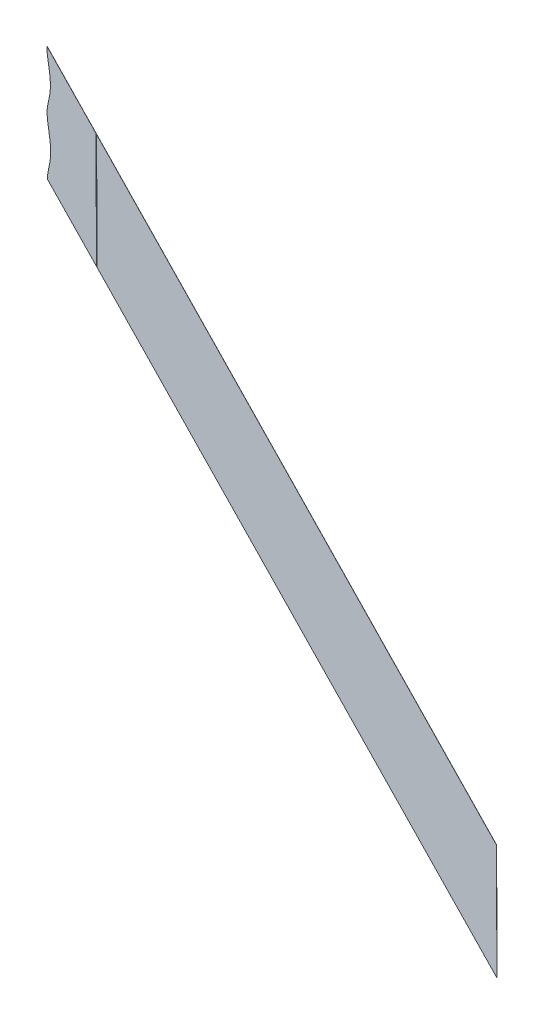
ISO-10303-21;
HEADER;
FILE_DESCRIPTION(('STEP AP214'),'2;1');
FILE_NAME('part.step','',(''),(''),'','','');
FILE_SCHEMA(('AUTOMOTIVE_DESIGN { 1 0 10303 214 1 1 1 1 }'));
ENDSEC;
DATA;
#1=APPLICATION_CONTEXT('core data for automotive mechanical design processes');
#2=APPLICATION_PROTOCOL_DEFINITION('international standard','automotive_design',2000,#1);
#3=PRODUCT_CONTEXT('',#1,'mechanical');
#4=PRODUCT('Part','Part','',(#3));
#5=PRODUCT_RELATED_PRODUCT_CATEGORY('part','',(#4));
#6=PRODUCT_DEFINITION_FORMATION('','',#4);
#7=PRODUCT_DEFINITION_CONTEXT('part definition',#1,'design');
#8=PRODUCT_DEFINITION('design','',#6,#7);
#9=PRODUCT_DEFINITION_SHAPE('','',#8);
#10=(LENGTH_UNIT() NAMED_UNIT(*) SI_UNIT(.MILLI.,.METRE.));
#11=(NAMED_UNIT(*) PLANE_ANGLE_UNIT() SI_UNIT($,.RADIAN.));
#12=(NAMED_UNIT(*) SI_UNIT($,.STERADIAN.) SOLID_ANGLE_UNIT());
#13=UNCERTAINTY_MEASURE_WITH_UNIT(LENGTH_MEASURE(1.E-05),#10,'distance_accuracy_value','');
#14=(GEOMETRIC_REPRESENTATION_CONTEXT(3) GLOBAL_UNCERTAINTY_ASSIGNED_CONTEXT((#13)) GLOBAL_UNIT_ASSIGNED_CONTEXT((#10,
#11,#12)) REPRESENTATION_CONTEXT('',''));
#15=CARTESIAN_POINT('',(0.,0.,0.));
#16=DIRECTION('',(0.,0.,1.));
#17=DIRECTION('',(1.,0.,0.));
#18=AXIS2_PLACEMENT_3D('',#15,#16,#17);
#19=CARTESIAN_POINT('',(635.389467683659,-79.4316688549312,337.647050536745));
#20=DIRECTION('',(0.00180154985013906,-0.999992126449228,-0.00353574004899396));
#21=DIRECTION('',(0.,0.00353574578677481,-0.99999374923133));
#22=AXIS2_PLACEMENT_3D('',#19,#20,#21);
#23=PLANE('',#22);
#24=DIRECTION('',(-0.891006492345561,0.,-0.453990562234571));
#25=VECTOR('',#24,1.);
#26=CARTESIAN_POINT('',(635.389467683659,-79.4316688549312,337.647050536745));
#27=LINE('',#26,#25);
#28=CARTESIAN_POINT('',(635.389467683659,-79.4316688549312,337.647050536745));
#29=VERTEX_POINT('',#28);
#30=CARTESIAN_POINT('',(74.9463839983014,-79.4316688549299,52.0869868911996));
#31=VERTEX_POINT('',#30);
#32=EDGE_CURVE('E111',#29,#31,#27,.T.);
#33=ORIENTED_EDGE('',*,*,#32,.T.);
#34=DIRECTION('',(-0.453986987716828,-0.00396825396825804,0.890999476960701));
#35=VECTOR('',#34,1.);
#36=CARTESIAN_POINT('',(79.4862538754697,-79.3919863152472,43.1769921215926));
#37=LINE('',#36,#35);
#38=CARTESIAN_POINT('',(74.9917826970728,-79.4312720295334,51.9978869435038));
#39=VERTEX_POINT('',#38);
#40=EDGE_CURVE('E60',#39,#31,#37,.T.);
#41=ORIENTED_EDGE('',*,*,#40,.F.);
#42=DIRECTION('',(-0.891006492345561,0.,-0.453990562234571));
#43=VECTOR('',#42,1.);
#44=CARTESIAN_POINT('',(635.434866382431,-79.4312720295343,337.557950589049));
#45=LINE('',#44,#43);
#46=CARTESIAN_POINT('',(635.434866382431,-79.4312720295343,337.557950589049));
#47=VERTEX_POINT('',#46);
#48=EDGE_CURVE('E54',#47,#39,#45,.T.);
#49=ORIENTED_EDGE('',*,*,#48,.F.);
#50=DIRECTION('',(0.453986987716831,0.00396825396825805,-0.890999476960699));
#51=VECTOR('',#50,1.);
#52=CARTESIAN_POINT('',(635.389467683659,-79.4316688549312,337.647050536745));
#53=LINE('',#52,#51);
#54=EDGE_CURVE('E112',#29,#47,#53,.T.);
#55=ORIENTED_EDGE('',*,*,#54,.F.);
#56=EDGE_LOOP('',(#33,#41,#49,#55));
#57=FACE_BOUND('',#56,.T.);
#58=ADVANCED_FACE('F51',(#57),#23,.T.);
#59=CARTESIAN_POINT('',(635.389467683659,-79.4316688549312,337.647050536745));
#60=DIRECTION('',(-0.891006492345559,0.,-0.453990562234575));
#61=DIRECTION('',(-0.453990562234575,0.,0.891006492345558));
#62=AXIS2_PLACEMENT_3D('',#59,#60,#61);
#63=PLANE('',#62);
#64=DIRECTION('',(-0.00180154985013892,0.999992126449228,0.00353574004899426));
#65=VECTOR('',#64,1.);
#66=CARTESIAN_POINT('',(635.434866382431,-79.4312720295343,337.557950589049));
#67=LINE('',#66,#65);
#68=CARTESIAN_POINT('',(635.291855937702,-0.0500000000001055,337.838624341603));
#69=VERTEX_POINT('',#68);
#70=EDGE_CURVE('E113',#47,#69,#67,.T.);
#71=ORIENTED_EDGE('',*,*,#70,.T.);
#72=DIRECTION('',(0.453986987716831,0.00396825396825805,-0.890999476960699));
#73=VECTOR('',#72,1.);
#74=CARTESIAN_POINT('',(635.24645723893,-0.0503968253969048,337.927724289299));
#75=LINE('',#74,#73);
#76=CARTESIAN_POINT('',(635.24645723893,-0.0503968253969048,337.927724289299));
#77=VERTEX_POINT('',#76);
#78=EDGE_CURVE('E129',#77,#69,#75,.T.);
#79=ORIENTED_EDGE('',*,*,#78,.F.);
#80=DIRECTION('',(-0.00180154985013892,0.999992126449228,0.00353574004899426));
#81=VECTOR('',#80,1.);
#82=CARTESIAN_POINT('',(635.389467683659,-79.4316688549312,337.647050536745));
#83=LINE('',#82,#81);
#84=EDGE_CURVE('E95',#29,#77,#83,.T.);
#85=ORIENTED_EDGE('',*,*,#84,.F.);
#86=ORIENTED_EDGE('',*,*,#54,.T.);
#87=EDGE_LOOP('',(#71,#79,#85,#86));
#88=FACE_BOUND('',#87,.T.);
#89=ADVANCED_FACE('F153',(#88),#63,.F.);
#90=CARTESIAN_POINT('',(635.24645723893,-0.0503968253969048,337.927724289299));
#91=DIRECTION('',(0.00180154985013904,-0.999992126449228,-0.00353574004899397));
#92=DIRECTION('',(0.,0.00353574578677482,-0.99999374923133));
#93=AXIS2_PLACEMENT_3D('',#90,#91,#92);
#94=PLANE('',#93);
#95=DIRECTION('',(-0.891006492345561,0.,-0.453990562234571));
#96=VECTOR('',#95,1.);
#97=CARTESIAN_POINT('',(635.291855937702,-0.0500000000001055,337.838624341603));
#98=LINE('',#97,#96);
#99=CARTESIAN_POINT('',(73.957765759998,-0.0500000000000084,51.8245701338222));
#100=VERTEX_POINT('',#99);
#101=EDGE_CURVE('E123',#69,#100,#98,.T.);
#102=ORIENTED_EDGE('',*,*,#101,.T.);
#103=DIRECTION('',(-0.453986987716828,-0.00396825396825804,0.890999476960701));
#104=VECTOR('',#103,1.);
#105=CARTESIAN_POINT('',(78.4522369383956,-0.0107142857142806,43.003675311912));
#106=LINE('',#105,#104);
#107=CARTESIAN_POINT('',(73.9123670612273,-0.0503968253968631,51.9136700815191));
#108=VERTEX_POINT('',#107);
#109=EDGE_CURVE('E121',#100,#108,#106,.T.);
#110=ORIENTED_EDGE('',*,*,#109,.T.);
#111=DIRECTION('',(-0.891006492345561,0.,-0.453990562234571));
#112=VECTOR('',#111,1.);
#113=CARTESIAN_POINT('',(635.24645723893,-0.0503968253969048,337.927724289299));
#114=LINE('',#113,#112);
#115=EDGE_CURVE('E117',#77,#108,#114,.T.);
#116=ORIENTED_EDGE('',*,*,#115,.F.);
#117=ORIENTED_EDGE('',*,*,#78,.T.);
#118=EDGE_LOOP('',(#102,#110,#116,#117));
#119=FACE_BOUND('',#118,.T.);
#120=ADVANCED_FACE('F138',(#119),#94,.F.);
#121=CARTESIAN_POINT('',(6923.77608602789,7071.97520177728,3573.59092223117));
#122=DIRECTION('',(-0.453986987716828,-0.00396825396825805,0.890999476960702));
#123=DIRECTION('',(0.891006492345561,0.,0.453990562234571));
#124=AXIS2_PLACEMENT_3D('',#121,#122,#123);
#125=PLANE('',#124);
#126=DIRECTION('',(-0.891008313644605,0.00202190668477135,-0.453982485245365));
#127=VECTOR('',#126,1.);
#128=CARTESIAN_POINT('',(73.9123670612273,-0.0503968253968631,51.9136700815191));
#129=LINE('',#128,#127);
#130=CARTESIAN_POINT('',(74.8033771961746,-0.0524187362146294,52.3676534947462));
#131=VERTEX_POINT('',#130);
#132=EDGE_CURVE('E83',#131,#108,#129,.T.);
#133=ORIENTED_EDGE('',*,*,#132,.F.);
#134=DIRECTION('',(-0.00180154985013957,0.999992126449228,0.00353574004899367));
#135=VECTOR('',#134,1.);
#136=CARTESIAN_POINT('',(74.8033771961746,-0.0524187362146294,52.3676534947462));
#137=LINE('',#136,#135);
#138=EDGE_CURVE('E14',#31,#131,#137,.T.);
#139=ORIENTED_EDGE('',*,*,#138,.F.);
#140=ORIENTED_EDGE('',*,*,#32,.F.);
#141=ORIENTED_EDGE('',*,*,#84,.T.);
#142=ORIENTED_EDGE('',*,*,#115,.T.);
#143=EDGE_LOOP('',(#133,#139,#140,#141,#142));
#144=FACE_BOUND('',#143,.T.);
#145=ADVANCED_FACE('F115',(#144),#125,.T.);
#146=CARTESIAN_POINT('',(6923.82148472666,7071.97559860267,3573.50182228347));
#147=DIRECTION('',(-0.453986987716828,-0.00396825396825805,0.890999476960702));
#148=DIRECTION('',(0.891006492345561,0.,0.453990562234571));
#149=AXIS2_PLACEMENT_3D('',#146,#147,#148);
#150=PLANE('',#149);
#151=DIRECTION('',(-0.00180154985013958,0.999992126449228,0.00353574004899369));
#152=VECTOR('',#151,1.);
#153=CARTESIAN_POINT('',(62.1080652803956,7071.97559860267,77.2836017110054));
#154=LINE('',#153,#152);
#155=CARTESIAN_POINT('',(74.8487758949465,-0.0520219108180245,52.27855354705));
#156=VERTEX_POINT('',#155);
#157=EDGE_CURVE('E69',#39,#156,#154,.T.);
#158=ORIENTED_EDGE('',*,*,#157,.T.);
#159=DIRECTION('',(-0.891008313644605,0.00202190668477135,-0.453982485245365));
#160=VECTOR('',#159,1.);
#161=CARTESIAN_POINT('',(6923.82148472666,-15.5939461462485,3541.93583745574));
#162=LINE('',#161,#160);
#163=EDGE_CURVE('E141',#156,#100,#162,.T.);
#164=ORIENTED_EDGE('',*,*,#163,.T.);
#165=ORIENTED_EDGE('',*,*,#101,.F.);
#166=ORIENTED_EDGE('',*,*,#70,.F.);
#167=ORIENTED_EDGE('',*,*,#48,.T.);
#168=EDGE_LOOP('',(#158,#164,#165,#166,#167));
#169=FACE_BOUND('',#168,.T.);
#170=ADVANCED_FACE('F140',(#169),#150,.F.);
#171=CARTESIAN_POINT('',(78.4522369383956,-0.0107142857142806,43.003675311912));
#172=DIRECTION('',(0.,0.999990082377723,0.00445366660163498));
#173=DIRECTION('',(0.,-0.00445366660163497,0.999990082377721));
#174=AXIS2_PLACEMENT_3D('',#171,#172,#173);
#175=PLANE('',#174);
#176=DIRECTION('',(-0.453986987716828,-0.00396825396825804,0.890999476960701));
#177=VECTOR('',#176,1.);
#178=CARTESIAN_POINT('',(79.3432470733429,-0.0127361965320469,43.4576587251391));
#179=LINE('',#178,#177);
#180=EDGE_CURVE('E88',#156,#131,#179,.T.);
#181=ORIENTED_EDGE('',*,*,#180,.T.);
#182=ORIENTED_EDGE('',*,*,#132,.T.);
#183=ORIENTED_EDGE('',*,*,#109,.F.);
#184=ORIENTED_EDGE('',*,*,#163,.F.);
#185=EDGE_LOOP('',(#181,#182,#183,#184));
#186=FACE_BOUND('',#185,.T.);
#187=ADVANCED_FACE('F142',(#186),#175,.F.);
#188=CARTESIAN_POINT('',(79.3432470733429,-0.0127361965320469,43.4576587251391));
#189=DIRECTION('',(0.891006492345561,0.,0.453990562234571));
#190=DIRECTION('',(0.453990562234571,0.,-0.89100649234556));
#191=AXIS2_PLACEMENT_3D('',#188,#189,#190);
#192=PLANE('',#191);
#193=ORIENTED_EDGE('',*,*,#40,.T.);
#194=ORIENTED_EDGE('',*,*,#138,.T.);
#195=ORIENTED_EDGE('',*,*,#180,.F.);
#196=ORIENTED_EDGE('',*,*,#157,.F.);
#197=EDGE_LOOP('',(#193,#194,#195,#196));
#198=FACE_BOUND('',#197,.T.);
#199=ADVANCED_FACE('F104',(#198),#192,.F.);
#200=CLOSED_SHELL('',(#58,#89,#120,#145,#170,#187,#199));
#201=MANIFOLD_SOLID_BREP('B2',#200);
#202=CARTESIAN_POINT('',(5.26243410756988,-79.4316688549297,16.5812348440539));
#203=CARTESIAN_POINT('',(5.26360820461807,-78.7903415981819,16.5846893625954));
#204=CARTESIAN_POINT('',(5.38315197875217,-77.5183010933937,16.651265268905));
#205=CARTESIAN_POINT('',(5.60633965182744,-76.2627654905805,16.7705768805077));
#206=CARTESIAN_POINT('',(5.91481252200815,-75.0248945888949,16.9332648045656));
#207=CARTESIAN_POINT('',(6.283497687402,-73.8142124820426,17.1265113396988));
#208=CARTESIAN_POINT('',(6.50569227325659,-73.1667405947846,17.2426088080811));
#209=CARTESIAN_POINT('',(6.6891327830747,-72.6321975381458,17.3384571326777));
#210=CARTESIAN_POINT('',(6.93427442001482,-71.9623313779317,17.4663464472209));
#211=CARTESIAN_POINT('',(7.08742969014103,-71.5438242079673,17.5462468784966));
#212=CARTESIAN_POINT('',(7.68360811486507,-69.9490598814942,17.857117630064));
#213=CARTESIAN_POINT('',(7.81838363590942,-69.58316509782,17.9274187894516));
#214=CARTESIAN_POINT('',(8.06329199287503,-68.9182766255114,18.0551670727082));
#215=CARTESIAN_POINT('',(8.2511952720859,-68.3824910726237,18.1532948259991));
#216=CARTESIAN_POINT('',(8.47487728190888,-67.7446864009421,18.2701071198972));
#217=CARTESIAN_POINT('',(8.86026724835332,-66.5491076386062,18.4717979118415));
#218=CARTESIAN_POINT('',(9.20571426589994,-65.3359620430262,18.6532149888603));
#219=CARTESIAN_POINT('',(9.66031458923566,-63.4327716841247,18.8933217225139));
#220=CARTESIAN_POINT('',(9.98064818673566,-60.8993366893968,19.0678230577956));
#221=CARTESIAN_POINT('',(9.97704735823107,-58.3434287451987,19.0773716184581));
#222=CARTESIAN_POINT('',(9.65102042077526,-55.8134844401254,18.9225202080032));
#223=CARTESIAN_POINT('',(9.18940384415612,-53.9025220958486,18.695825647101));
#224=CARTESIAN_POINT('',(8.83555751423237,-52.6742248665406,18.5210023861336));
#225=CARTESIAN_POINT('',(8.44258217525118,-51.4694471261906,18.3261371467796));
#226=CARTESIAN_POINT('',(8.21622924595738,-50.8309199627601,18.2136483640446));
#227=CARTESIAN_POINT('',(8.0263866596153,-50.2953861460189,18.1193038308613));
#228=CARTESIAN_POINT('',(7.77877296139545,-49.629838670572,17.9961024840592));
#229=CARTESIAN_POINT('',(7.64475732479142,-49.2696252847504,17.929422380976));
#230=CARTESIAN_POINT('',(7.04030688288171,-47.6681057861711,17.6285721491038));
#231=CARTESIAN_POINT('',(6.88450293252568,-47.2463056234553,17.551064633429));
#232=CARTESIAN_POINT('',(6.63885014534227,-46.5812622444663,17.4288601757772));
#233=CARTESIAN_POINT('',(6.45443071749824,-46.04917858313,17.3372635143505));
#234=CARTESIAN_POINT('',(6.22842480620445,-45.3971103375434,17.2250118542116));
#235=CARTESIAN_POINT('',(5.85508208779212,-44.1831419232214,17.0401908690163));
#236=CARTESIAN_POINT('',(5.54349746587451,-42.9469293208017,16.8869362803336));
#237=CARTESIAN_POINT('',(5.31536778495478,-41.6838793347448,16.7763236412931));
#238=CARTESIAN_POINT('',(5.19344206561179,-40.4080347140491,16.7198816164984));
#239=CARTESIAN_POINT('',(5.18838925509585,-39.1296473607725,16.7230006480283));
#240=CARTESIAN_POINT('',(5.30143777696679,-37.849506187753,16.7863031354689));
#241=CARTESIAN_POINT('',(5.52139704889354,-36.5842778222442,16.904012963001));
#242=CARTESIAN_POINT('',(5.82690474706943,-35.3422762899024,17.0652084528331));
#243=CARTESIAN_POINT('',(6.19461349446027,-34.1264519634747,17.2579803800169));
#244=CARTESIAN_POINT('',(6.41574784360521,-33.4794812591749,17.3735353985948));
#245=CARTESIAN_POINT('',(6.59803197951531,-32.9461742616463,17.4687890161045));
#246=CARTESIAN_POINT('',(6.84009593349094,-32.2832731018389,17.5950791524827));
#247=CARTESIAN_POINT('',(6.99837954184968,-31.8498075410417,17.6776592234008));
#248=CARTESIAN_POINT('',(7.28353705906987,-31.0868944241983,17.8263520550992));
#249=CARTESIAN_POINT('',(7.60346865574918,-30.2309464064917,17.993177518877));
#250=CARTESIAN_POINT('',(7.72840866401131,-29.8921951973309,18.0583463436948));
#251=CARTESIAN_POINT('',(7.97273423146111,-29.2297526174673,18.1857867875117));
#252=CARTESIAN_POINT('',(8.15933409306052,-28.6993508066504,18.2832264386132));
#253=CARTESIAN_POINT('',(8.38399909546711,-28.0607505253835,18.4005431357501));
#254=CARTESIAN_POINT('',(8.77436500955092,-26.8556419217662,18.6048117432491));
#255=CARTESIAN_POINT('',(9.12516484477754,-25.6294670906531,18.7890142460217));
#256=CARTESIAN_POINT('',(9.58322616728002,-23.7214957593647,19.0309057402054));
#257=CARTESIAN_POINT('',(9.90621019242899,-21.1952564870325,19.2067254883942));
#258=CARTESIAN_POINT('',(9.90832242137635,-18.639971985395,19.2191822210949));
#259=CARTESIAN_POINT('',(9.58489079000935,-16.1011199187427,19.0656928579645));
#260=CARTESIAN_POINT('',(9.12514805390413,-14.1894551684197,18.8399561949716));
#261=CARTESIAN_POINT('',(8.77291110328271,-12.9624297045966,18.6659472897829));
#262=CARTESIAN_POINT('',(8.37963591533458,-11.7537572562719,18.4709466156263));
#263=CARTESIAN_POINT('',(8.15204437545808,-11.1110030669795,18.3578455551181));
#264=CARTESIAN_POINT('',(7.96261738267007,-10.5760315419164,18.2637102731795));
#265=CARTESIAN_POINT('',(7.71639970101073,-9.91380101090864,18.1412054597547));
#266=CARTESIAN_POINT('',(7.57807555584367,-9.5417624493924,18.0723827274408));
#267=CARTESIAN_POINT('',(6.97331305202187,-7.93950863707089,17.7713767624766));
#268=CARTESIAN_POINT('',(6.81849893632075,-7.52060554756305,17.6943606901104));
#269=CARTESIAN_POINT('',(6.57279918590459,-6.85577996577123,17.5721313334865));
#270=CARTESIAN_POINT('',(6.38851747002717,-6.32472938864776,17.4806002387654));
#271=CARTESIAN_POINT('',(6.16480874240433,-5.68006071739308,17.3694860968081));
#272=CARTESIAN_POINT('',(5.79156333118458,-4.47093824148346,17.1846931097042));
#273=CARTESIAN_POINT('',(5.47711780115756,-3.23040520617141,17.0300000572367));
#274=CARTESIAN_POINT('',(5.24795425424562,-1.97088459782999,16.9188449182429));
#275=CARTESIAN_POINT('',(5.1229222384655,-0.69424426861648,16.8608236999407));
#276=CARTESIAN_POINT('',(5.11942366284029,-0.0503968253958223,16.8619085966075));
#277=B_SPLINE_CURVE_WITH_KNOTS('',2,(#202,#203,#204,#205,#206,#207,#208,#209,#210,#211,#212,
#213,#214,#215,#216,#217,#218,#219,#220,#221,#222,#223,#224,#225,#226,#227,#228,#229,#230,#231,
#232,#233,#234,#235,#236,#237,#238,#239,#240,#241,#242,#243,#244,#245,#246,#247,#248,#249,#250,
#251,#252,#253,#254,#255,#256,#257,#258,#259,#260,#261,#262,#263,#264,#265,#266,#267,#268,#269,
#270,#271,#272,#273,#274,#275,#276),.UNSPECIFIED.,.F.,.F.,(3,1,1,1,1,2,2,1,2,2,1,1,1,1,1,1,1,1,
1,2,2,1,2,2,1,1,1,1,1,1,1,1,1,2,2,2,2,2,1,1,1,1,1,1,1,1,1,2,2,1,2,2,1,1,1,1,3),(0.,0.015625,
0.03125,0.046875,0.0625,0.078125,0.09375,0.109375,0.125,0.140625,0.15625,0.171875,0.1875,
0.21875,0.25,0.28125,0.3125,0.328125,0.34375,0.359375,0.375,0.390625,0.40625,0.421875,0.4375,
0.453125,0.46875,0.484375,0.5,0.515625,0.53125,0.546875,0.5625,0.578125,0.59375,0.609375,0.625,
0.640625,0.65625,0.671875,0.6875,0.71875,0.75,0.78125,0.8125,0.828125,0.84375,0.859375,0.875,
0.890625,0.90625,0.921875,0.9375,0.953125,0.96875,0.984375,1.),.UNSPECIFIED.);
#278=DIRECTION('',(0.453986987716831,0.00396825396825805,-0.890999476960699));
#279=VECTOR('',#278,1.);
#280=SURFACE_OF_LINEAR_EXTRUSION('',#277,#279);
#281=CARTESIAN_POINT('',(5.30783280634156,-79.4312720295328,16.4921348963578));
#282=CARTESIAN_POINT('',(5.30900690338981,-78.789944772785,16.4955894148995));
#283=CARTESIAN_POINT('',(5.42855067752385,-77.5179042679968,16.562165321209));
#284=CARTESIAN_POINT('',(5.65173835059907,-76.2623686651838,16.6814769328116));
#285=CARTESIAN_POINT('',(5.96021122077983,-75.0244977634981,16.8441648568696));
#286=CARTESIAN_POINT('',(6.32889638617357,-73.8138156566458,17.0374113920028));
#287=CARTESIAN_POINT('',(6.55109097202827,-73.1663437693878,17.153508860385));
#288=CARTESIAN_POINT('',(6.73453148184638,-72.631800712749,17.2493571849816));
#289=CARTESIAN_POINT('',(6.9796731187865,-71.961934552535,17.3772464995249));
#290=CARTESIAN_POINT('',(7.13282838891272,-71.5434273825705,17.4571469308005));
#291=CARTESIAN_POINT('',(7.72900681363675,-69.9486630560974,17.7680176823679));
#292=CARTESIAN_POINT('',(7.8637823346811,-69.5827682724232,17.8383188417556));
#293=CARTESIAN_POINT('',(8.10869069164671,-68.9178798001146,17.9660671250122));
#294=CARTESIAN_POINT('',(8.29659397085758,-68.3820942472268,18.0641948783031));
#295=CARTESIAN_POINT('',(8.52027598068078,-67.7442895755453,18.1810071722012));
#296=CARTESIAN_POINT('',(8.905665947125,-66.5487108132094,18.3826979641454));
#297=CARTESIAN_POINT('',(9.25111296467163,-65.3355652176294,18.5641150411643));
#298=CARTESIAN_POINT('',(9.70571328800718,-63.4323748587279,18.8042217748178));
#299=CARTESIAN_POINT('',(10.0260468855073,-60.898939864,18.9787231100996));
#300=CARTESIAN_POINT('',(10.0224460570028,-58.3430319198019,18.988271670762));
#301=CARTESIAN_POINT('',(9.69641911954694,-55.8130876147286,18.8334202603071));
#302=CARTESIAN_POINT('',(9.2348025429278,-53.9021252704518,18.606725699405));
#303=CARTESIAN_POINT('',(8.88095621300405,-52.6738280411437,18.4319024384375));
#304=CARTESIAN_POINT('',(8.48798087402286,-51.4690503007939,18.2370371990835));
#305=CARTESIAN_POINT('',(8.26162794472912,-50.8305231373632,18.1245484163485));
#306=CARTESIAN_POINT('',(8.07178535838698,-50.2949893206221,18.0302038831652));
#307=CARTESIAN_POINT('',(7.82417166016713,-49.6294418451751,17.9070025363631));
#308=CARTESIAN_POINT('',(7.6901560235631,-49.2692284593536,17.8403224332799));
#309=CARTESIAN_POINT('',(7.08570558165339,-47.6677089607744,17.5394722014078));
#310=CARTESIAN_POINT('',(6.92990163129731,-47.2459087980585,17.4619646857329));
#311=CARTESIAN_POINT('',(6.68424884411395,-46.5808654190695,17.3397602280812));
#312=CARTESIAN_POINT('',(6.49982941626992,-46.0487817577332,17.2481635666544));
#313=CARTESIAN_POINT('',(6.27382350497591,-45.3967135121466,17.1359119065155));
#314=CARTESIAN_POINT('',(5.9004807865638,-44.1827450978246,16.9510909213202));
#315=CARTESIAN_POINT('',(5.5888961646462,-42.9465324954049,16.7978363326375));
#316=CARTESIAN_POINT('',(5.36076648372647,-41.683482509348,16.687223693597));
#317=CARTESIAN_POINT('',(5.23884076438347,-40.4076378886523,16.6307816688023));
#318=CARTESIAN_POINT('',(5.23378795386753,-39.1292505353756,16.6339007003322));
#319=CARTESIAN_POINT('',(5.34683647573847,-37.8491093623562,16.6972031877729));
#320=CARTESIAN_POINT('',(5.56679574766522,-36.5838809968474,16.8149130153049));
#321=CARTESIAN_POINT('',(5.87230344584111,-35.3418794645056,16.9761085051371));
#322=CARTESIAN_POINT('',(6.24001219323195,-34.1260551380778,17.1688804323208));
#323=CARTESIAN_POINT('',(6.46114654237689,-33.4790844337781,17.2844354508987));
#324=CARTESIAN_POINT('',(6.64343067828699,-32.9457774362495,17.3796890684084));
#325=CARTESIAN_POINT('',(6.88549463226262,-32.2828762764421,17.5059792047867));
#326=CARTESIAN_POINT('',(7.04377824062136,-31.8494107156449,17.5885592757047));
#327=CARTESIAN_POINT('',(7.32893575784155,-31.0864975988015,17.7372521074031));
#328=CARTESIAN_POINT('',(7.64886735452086,-30.2305495810949,17.9040775711809));
#329=CARTESIAN_POINT('',(7.77380736278299,-29.8917983719341,17.9692463959987));
#330=CARTESIAN_POINT('',(8.01813293023279,-29.2293557920705,18.0966868398156));
#331=CARTESIAN_POINT('',(8.2047327918322,-28.6989539812535,18.1941264909171));
#332=CARTESIAN_POINT('',(8.42939779423879,-28.0603536999867,18.3114431880541));
#333=CARTESIAN_POINT('',(8.8197637083226,-26.8552450963693,18.5157117955531));
#334=CARTESIAN_POINT('',(9.17056354354917,-25.6290702652563,18.6999142983257));
#335=CARTESIAN_POINT('',(9.62862486605171,-23.7210989339679,18.9418057925094));
#336=CARTESIAN_POINT('',(9.95160889120067,-21.1948596616356,19.1176255406981));
#337=CARTESIAN_POINT('',(9.95372112014803,-18.6395751599982,19.1300822733989));
#338=CARTESIAN_POINT('',(9.63028948878103,-16.1007230933459,18.9765929102684));
#339=CARTESIAN_POINT('',(9.17054675267581,-14.1890583430229,18.7508562472755));
#340=CARTESIAN_POINT('',(8.81830980205439,-12.9620328791998,18.5768473420869));
#341=CARTESIAN_POINT('',(8.42503461410626,-11.7533604308751,18.3818466679302));
#342=CARTESIAN_POINT('',(8.19744307422976,-11.1106062415827,18.2687456074221));
#343=CARTESIAN_POINT('',(8.00801608144169,-10.5756347165196,18.1746103254834));
#344=CARTESIAN_POINT('',(7.76179839978242,-9.9134041855118,18.0521055120586));
#345=CARTESIAN_POINT('',(7.62347425461535,-9.54136562399558,17.9832827797447));
#346=CARTESIAN_POINT('',(7.01871175079349,-7.93911181167406,17.6822768147806));
#347=CARTESIAN_POINT('',(6.86389763509232,-7.52020872216622,17.6052607424143));
#348=CARTESIAN_POINT('',(6.61819788467627,-6.85538314037441,17.4830313857904));
#349=CARTESIAN_POINT('',(6.43391616879885,-6.32433256325093,17.3915002910693));
#350=CARTESIAN_POINT('',(6.21020744117601,-5.67966389199626,17.280386149112));
#351=CARTESIAN_POINT('',(5.83696202995626,-4.4705414160866,17.0955931620081));
#352=CARTESIAN_POINT('',(5.52251649992924,-3.23000838077458,16.9409001095406));
#353=CARTESIAN_POINT('',(5.2933529530173,-1.97048777243314,16.8297449705469));
#354=CARTESIAN_POINT('',(5.16832093723718,-0.693847443219653,16.7717237522447));
#355=CARTESIAN_POINT('',(5.16482236161198,-0.0499999999989953,16.7728086489114));
#356=B_SPLINE_CURVE_WITH_KNOTS('',2,(#281,#282,#283,#284,#285,#286,#287,#288,#289,#290,#291,
#292,#293,#294,#295,#296,#297,#298,#299,#300,#301,#302,#303,#304,#305,#306,#307,#308,#309,#310,
#311,#312,#313,#314,#315,#316,#317,#318,#319,#320,#321,#322,#323,#324,#325,#326,#327,#328,#329,
#330,#331,#332,#333,#334,#335,#336,#337,#338,#339,#340,#341,#342,#343,#344,#345,#346,#347,#348,
#349,#350,#351,#352,#353,#354,#355),.UNSPECIFIED.,.F.,.F.,(3,1,1,1,1,2,2,1,2,2,1,1,1,1,1,1,1,1,
1,2,2,1,2,2,1,1,1,1,1,1,1,1,1,2,2,2,2,2,1,1,1,1,1,1,1,1,1,2,2,1,2,2,1,1,1,1,3),(0.,0.015625,
0.03125,0.046875,0.0625,0.078125,0.09375,0.109375,0.125,0.140625,0.15625,0.171875,0.1875,
0.21875,0.25,0.28125,0.3125,0.328125,0.34375,0.359375,0.375,0.390625,0.40625,0.421875,0.4375,
0.453125,0.46875,0.484375,0.5,0.515625,0.53125,0.546875,0.5625,0.578125,0.59375,0.609375,0.625,
0.640625,0.65625,0.671875,0.6875,0.71875,0.75,0.78125,0.8125,0.828125,0.84375,0.859375,0.875,
0.890625,0.90625,0.921875,0.9375,0.953125,0.96875,0.984375,1.),.UNSPECIFIED.);
#357=CARTESIAN_POINT('',(5.30783280634156,-79.4312720295328,16.4921348963578));
#358=VERTEX_POINT('',#357);
#359=CARTESIAN_POINT('',(5.16482236161186,-0.0500000000000708,16.7728086489116));
#360=VERTEX_POINT('',#359);
#361=EDGE_CURVE('E253',#358,#360,#356,.T.);
#362=ORIENTED_EDGE('',*,*,#361,.F.);
#363=DIRECTION('',(0.453986987716831,0.00396825396825805,-0.890999476960699));
#364=VECTOR('',#363,1.);
#365=CARTESIAN_POINT('',(5.26243410756988,-79.4316688549297,16.5812348440539));
#366=LINE('',#365,#364);
#367=CARTESIAN_POINT('',(5.26243410756988,-79.4316688549297,16.5812348440539));
#368=VERTEX_POINT('',#367);
#369=EDGE_CURVE('E261',#368,#358,#366,.T.);
#370=ORIENTED_EDGE('',*,*,#369,.F.);
#371=CARTESIAN_POINT('',(5.11942366284018,-0.0503968253968631,16.8619085966077));
#372=VERTEX_POINT('',#371);
#373=EDGE_CURVE('E255',#368,#372,#277,.T.);
#374=ORIENTED_EDGE('',*,*,#373,.T.);
#375=DIRECTION('',(0.453986987716831,0.00396825396825805,-0.890999476960699));
#376=VECTOR('',#375,1.);
#377=CARTESIAN_POINT('',(5.11942366284018,-0.0503968253968631,16.8619085966077));
#378=LINE('',#377,#376);
#379=EDGE_CURVE('E297',#372,#360,#378,.T.);
#380=ORIENTED_EDGE('',*,*,#379,.T.);
#381=EDGE_LOOP('',(#362,#370,#374,#380));
#382=FACE_BOUND('',#381,.T.);
#383=ADVANCED_FACE('F188',(#382),#280,.T.);
#384=CARTESIAN_POINT('',(6923.77608602789,7071.97520177728,3573.59092223117));
#385=DIRECTION('',(-0.453986987716828,-0.00396825396825805,0.890999476960702));
#386=DIRECTION('',(0.891006492345561,0.,0.453990562234571));
#387=AXIS2_PLACEMENT_3D('',#384,#385,#386);
#388=PLANE('',#387);
#389=DIRECTION('',(0.00180154985013782,-0.999992126449228,-0.00353574004899454));
#390=VECTOR('',#389,1.);
#391=CARTESIAN_POINT('',(73.9123670612273,-0.0503968253968631,51.9136700815191));
#392=LINE('',#391,#390);
#393=CARTESIAN_POINT('',(73.9123670612273,-0.0503968253968631,51.9136700815191));
#394=VERTEX_POINT('',#393);
#395=CARTESIAN_POINT('',(74.055373863354,-79.4296469441121,51.6330034779723));
#396=VERTEX_POINT('',#395);
#397=EDGE_CURVE('E241',#394,#396,#392,.T.);
#398=ORIENTED_EDGE('',*,*,#397,.F.);
#399=DIRECTION('',(-0.891006492345561,0.,-0.453990562234571));
#400=VECTOR('',#399,1.);
#401=CARTESIAN_POINT('',(635.24645723893,-0.0503968253969048,337.927724289299));
#402=LINE('',#401,#400);
#403=EDGE_CURVE('E252',#394,#372,#402,.T.);
#404=ORIENTED_EDGE('',*,*,#403,.T.);
#405=ORIENTED_EDGE('',*,*,#373,.F.);
#406=DIRECTION('',(-0.891006492345561,0.,-0.453990562234571));
#407=VECTOR('',#406,1.);
#408=CARTESIAN_POINT('',(635.389467683659,-79.4316688549312,337.647050536745));
#409=LINE('',#408,#407);
#410=CARTESIAN_POINT('',(74.9463839983014,-79.4316688549299,52.0869868911996));
#411=VERTEX_POINT('',#410);
#412=EDGE_CURVE('E248',#411,#368,#409,.T.);
#413=ORIENTED_EDGE('',*,*,#412,.F.);
#414=DIRECTION('',(0.891008313644606,-0.00202190668478258,0.453982485245364));
#415=VECTOR('',#414,1.);
#416=CARTESIAN_POINT('',(74.055373863354,-79.4296469441121,51.6330034779723));
#417=LINE('',#416,#415);
#418=EDGE_CURVE('E234',#396,#411,#417,.T.);
#419=ORIENTED_EDGE('',*,*,#418,.F.);
#420=EDGE_LOOP('',(#398,#404,#405,#413,#419));
#421=FACE_BOUND('',#420,.T.);
#422=ADVANCED_FACE('F246',(#421),#388,.T.);
#423=CARTESIAN_POINT('',(6923.82148472666,7071.97559860267,3573.50182228347));
#424=DIRECTION('',(-0.453986987716828,-0.00396825396825805,0.890999476960702));
#425=DIRECTION('',(0.891006492345561,0.,0.453990562234571));
#426=AXIS2_PLACEMENT_3D('',#423,#424,#425);
#427=PLANE('',#426);
#428=DIRECTION('',(-0.891006492345561,0.,-0.453990562234571));
#429=VECTOR('',#428,1.);
#430=CARTESIAN_POINT('',(635.291855937702,-0.0500000000001055,337.838624341603));
#431=LINE('',#430,#429);
#432=CARTESIAN_POINT('',(73.957765759998,-0.0500000000000084,51.8245701338222));
#433=VERTEX_POINT('',#432);
#434=EDGE_CURVE('E283',#433,#360,#431,.T.);
#435=ORIENTED_EDGE('',*,*,#434,.F.);
#436=DIRECTION('',(0.00180154985013784,-0.999992126449228,-0.00353574004899457));
#437=VECTOR('',#436,1.);
#438=CARTESIAN_POINT('',(61.2170587880628,7071.97559860268,76.8296111487774));
#439=LINE('',#438,#437);
#440=CARTESIAN_POINT('',(74.100772562125,-79.4292501187156,51.5439035302764));
#441=VERTEX_POINT('',#440);
#442=EDGE_CURVE('E286',#433,#441,#439,.T.);
#443=ORIENTED_EDGE('',*,*,#442,.T.);
#444=DIRECTION('',(0.891008313644605,-0.00202190668478258,0.453982485245364));
#445=VECTOR('',#444,1.);
#446=CARTESIAN_POINT('',(6923.82148472659,-94.9728717491009,3541.58230667969));
#447=LINE('',#446,#445);
#448=CARTESIAN_POINT('',(74.9917823237043,-79.4312720291104,51.997886753265));
#449=VERTEX_POINT('',#448);
#450=EDGE_CURVE('E236',#441,#449,#447,.T.);
#451=ORIENTED_EDGE('',*,*,#450,.T.);
#452=DIRECTION('',(-0.891006492345561,0.,-0.453990562234571));
#453=VECTOR('',#452,1.);
#454=CARTESIAN_POINT('',(635.434866382431,-79.4312720295343,337.557950589049));
#455=LINE('',#454,#453);
#456=EDGE_CURVE('E238',#449,#358,#455,.T.);
#457=ORIENTED_EDGE('',*,*,#456,.T.);
#458=ORIENTED_EDGE('',*,*,#361,.T.);
#459=EDGE_LOOP('',(#435,#443,#451,#457,#458));
#460=FACE_BOUND('',#459,.T.);
#461=ADVANCED_FACE('F270',(#460),#427,.F.);
#462=CARTESIAN_POINT('',(635.24645723893,-0.0503968253969048,337.927724289299));
#463=DIRECTION('',(0.00180154985013904,-0.999992126449228,-0.00353574004899397));
#464=DIRECTION('',(0.,0.00353574578677482,-0.99999374923133));
#465=AXIS2_PLACEMENT_3D('',#462,#463,#464);
#466=PLANE('',#465);
#467=DIRECTION('',(-0.453986987716823,-0.00396825396825806,0.890999476960704));
#468=VECTOR('',#467,1.);
#469=CARTESIAN_POINT('',(73.9123670612252,-0.050396825396877,51.9136700815226));
#470=LINE('',#469,#468);
#471=EDGE_CURVE('E49',#433,#394,#470,.T.);
#472=ORIENTED_EDGE('',*,*,#471,.F.);
#473=ORIENTED_EDGE('',*,*,#434,.T.);
#474=ORIENTED_EDGE('',*,*,#379,.F.);
#475=ORIENTED_EDGE('',*,*,#403,.F.);
#476=EDGE_LOOP('',(#472,#473,#474,#475));
#477=FACE_BOUND('',#476,.T.);
#478=ADVANCED_FACE('F272',(#477),#466,.F.);
#479=CARTESIAN_POINT('',(635.389467683659,-79.4316688549312,337.647050536745));
#480=DIRECTION('',(0.00180154985013906,-0.999992126449228,-0.00353574004899396));
#481=DIRECTION('',(0.,0.00353574578677481,-0.99999374923133));
#482=AXIS2_PLACEMENT_3D('',#479,#480,#481);
#483=PLANE('',#482);
#484=DIRECTION('',(0.453986987716823,0.00396825396825805,-0.890999476960704));
#485=VECTOR('',#484,1.);
#486=CARTESIAN_POINT('',(74.9463839988583,-79.4316688549311,52.0869868914878));
#487=LINE('',#486,#485);
#488=EDGE_CURVE('E192',#411,#449,#487,.T.);
#489=ORIENTED_EDGE('',*,*,#488,.F.);
#490=ORIENTED_EDGE('',*,*,#412,.T.);
#491=ORIENTED_EDGE('',*,*,#369,.T.);
#492=ORIENTED_EDGE('',*,*,#456,.F.);
#493=EDGE_LOOP('',(#489,#490,#491,#492));
#494=FACE_BOUND('',#493,.T.);
#495=ADVANCED_FACE('F190',(#494),#483,.T.);
#496=CARTESIAN_POINT('',(78.5952437405223,-79.3899644044296,42.7230087083653));
#497=DIRECTION('',(0.,-0.999990082377724,-0.00445366660164008));
#498=DIRECTION('',(0.,0.00445366660164007,-0.999990082377721));
#499=AXIS2_PLACEMENT_3D('',#496,#497,#498);
#500=PLANE('',#499);
#501=DIRECTION('',(-0.453986987716828,-0.00396825396825804,0.890999476960701));
#502=VECTOR('',#501,1.);
#503=CARTESIAN_POINT('',(78.5952437405223,-79.3899644044296,42.7230087083653));
#504=LINE('',#503,#502);
#505=EDGE_CURVE('E231',#441,#396,#504,.T.);
#506=ORIENTED_EDGE('',*,*,#505,.T.);
#507=ORIENTED_EDGE('',*,*,#418,.T.);
#508=ORIENTED_EDGE('',*,*,#488,.T.);
#509=ORIENTED_EDGE('',*,*,#450,.F.);
#510=EDGE_LOOP('',(#506,#507,#508,#509));
#511=FACE_BOUND('',#510,.T.);
#512=ADVANCED_FACE('F232',(#511),#500,.F.);
#513=CARTESIAN_POINT('',(78.4522369383956,-0.0107142857142806,43.003675311912));
#514=DIRECTION('',(-0.891006492345561,0.,-0.453990562234571));
#515=DIRECTION('',(-0.453990562234571,0.,0.89100649234556));
#516=AXIS2_PLACEMENT_3D('',#513,#514,#515);
#517=PLANE('',#516);
#518=ORIENTED_EDGE('',*,*,#471,.T.);
#519=ORIENTED_EDGE('',*,*,#397,.T.);
#520=ORIENTED_EDGE('',*,*,#505,.F.);
#521=ORIENTED_EDGE('',*,*,#442,.F.);
#522=EDGE_LOOP('',(#518,#519,#520,#521));
#523=FACE_BOUND('',#522,.T.);
#524=ADVANCED_FACE('F242',(#523),#517,.F.);
#525=CLOSED_SHELL('',(#383,#422,#461,#478,#495,#512,#524));
#526=MANIFOLD_SOLID_BREP('B8',#525);
#527=ADVANCED_BREP_SHAPE_REPRESENTATION('',(#18,#201,#526),#14);
#528=SHAPE_DEFINITION_REPRESENTATION(#9,#527);
ENDSEC;
END-ISO-10303-21;
